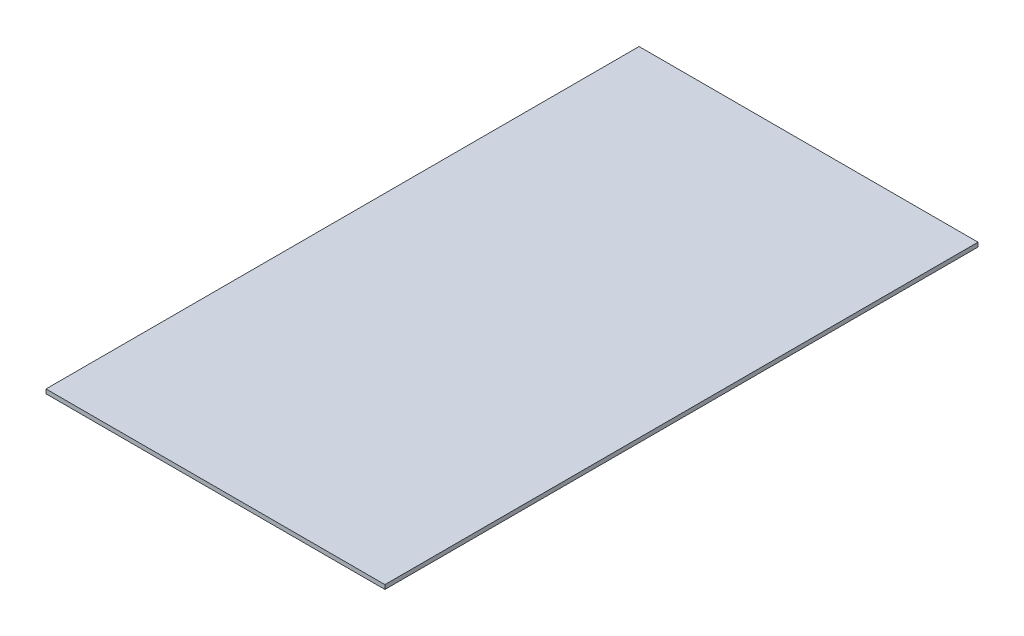
ISO-10303-21;
HEADER;
FILE_DESCRIPTION(('STEP AP214'),'2;1');
FILE_NAME('part.step','',(''),(''),'','','');
FILE_SCHEMA(('AUTOMOTIVE_DESIGN { 1 0 10303 214 1 1 1 1 }'));
ENDSEC;
DATA;
#1=APPLICATION_CONTEXT('core data for automotive mechanical design processes');
#2=APPLICATION_PROTOCOL_DEFINITION('international standard','automotive_design',2000,#1);
#3=PRODUCT_CONTEXT('',#1,'mechanical');
#4=PRODUCT('Part','Part','',(#3));
#5=PRODUCT_RELATED_PRODUCT_CATEGORY('part','',(#4));
#6=PRODUCT_DEFINITION_FORMATION('','',#4);
#7=PRODUCT_DEFINITION_CONTEXT('part definition',#1,'design');
#8=PRODUCT_DEFINITION('design','',#6,#7);
#9=PRODUCT_DEFINITION_SHAPE('','',#8);
#10=(LENGTH_UNIT() NAMED_UNIT(*) SI_UNIT(.MILLI.,.METRE.));
#11=(NAMED_UNIT(*) PLANE_ANGLE_UNIT() SI_UNIT($,.RADIAN.));
#12=(NAMED_UNIT(*) SI_UNIT($,.STERADIAN.) SOLID_ANGLE_UNIT());
#13=UNCERTAINTY_MEASURE_WITH_UNIT(LENGTH_MEASURE(1.E-05),#10,'distance_accuracy_value','');
#14=(GEOMETRIC_REPRESENTATION_CONTEXT(3) GLOBAL_UNCERTAINTY_ASSIGNED_CONTEXT((#13)) GLOBAL_UNIT_ASSIGNED_CONTEXT((#10,
#11,#12)) REPRESENTATION_CONTEXT('',''));
#15=CARTESIAN_POINT('',(0.,0.,0.));
#16=DIRECTION('',(0.,0.,1.));
#17=DIRECTION('',(1.,0.,0.));
#18=AXIS2_PLACEMENT_3D('',#15,#16,#17);
#19=CARTESIAN_POINT('',(-200.,5.,-350.));
#20=DIRECTION('',(1.,0.,0.));
#21=DIRECTION('',(0.,0.,-1.));
#22=AXIS2_PLACEMENT_3D('',#19,#20,#21);
#23=PLANE('',#22);
#24=DIRECTION('',(0.,0.,1.));
#25=VECTOR('',#24,1.);
#26=CARTESIAN_POINT('',(-200.,0.,-350.));
#27=LINE('',#26,#25);
#28=CARTESIAN_POINT('',(-200.,0.,-350.));
#29=VERTEX_POINT('',#28);
#30=CARTESIAN_POINT('',(-200.,0.,350.));
#31=VERTEX_POINT('',#30);
#32=EDGE_CURVE('E107',#29,#31,#27,.T.);
#33=ORIENTED_EDGE('',*,*,#32,.T.);
#34=DIRECTION('',(0.,-1.,0.));
#35=VECTOR('',#34,1.);
#36=CARTESIAN_POINT('',(-200.,5.,350.));
#37=LINE('',#36,#35);
#38=CARTESIAN_POINT('',(-200.,5.,350.));
#39=VERTEX_POINT('',#38);
#40=EDGE_CURVE('E11',#39,#31,#37,.T.);
#41=ORIENTED_EDGE('',*,*,#40,.F.);
#42=DIRECTION('',(0.,0.,1.));
#43=VECTOR('',#42,1.);
#44=CARTESIAN_POINT('',(-200.,5.,-350.));
#45=LINE('',#44,#43);
#46=CARTESIAN_POINT('',(-200.,5.,-350.));
#47=VERTEX_POINT('',#46);
#48=EDGE_CURVE('E91',#47,#39,#45,.T.);
#49=ORIENTED_EDGE('',*,*,#48,.F.);
#50=DIRECTION('',(0.,-1.,0.));
#51=VECTOR('',#50,1.);
#52=CARTESIAN_POINT('',(-200.,5.,-350.));
#53=LINE('',#52,#51);
#54=EDGE_CURVE('E103',#47,#29,#53,.T.);
#55=ORIENTED_EDGE('',*,*,#54,.T.);
#56=EDGE_LOOP('',(#33,#41,#49,#55));
#57=FACE_BOUND('',#56,.T.);
#58=ADVANCED_FACE('F39',(#57),#23,.F.);
#59=CARTESIAN_POINT('',(-200.,5.,350.));
#60=DIRECTION('',(0.,0.,-1.));
#61=DIRECTION('',(-1.,0.,0.));
#62=AXIS2_PLACEMENT_3D('',#59,#60,#61);
#63=PLANE('',#62);
#64=DIRECTION('',(1.,0.,0.));
#65=VECTOR('',#64,1.);
#66=CARTESIAN_POINT('',(-200.,0.,350.));
#67=LINE('',#66,#65);
#68=CARTESIAN_POINT('',(200.,0.,350.));
#69=VERTEX_POINT('',#68);
#70=EDGE_CURVE('E96',#31,#69,#67,.T.);
#71=ORIENTED_EDGE('',*,*,#70,.T.);
#72=DIRECTION('',(0.,-1.,0.));
#73=VECTOR('',#72,1.);
#74=CARTESIAN_POINT('',(200.,5.,350.));
#75=LINE('',#74,#73);
#76=CARTESIAN_POINT('',(200.,5.,350.));
#77=VERTEX_POINT('',#76);
#78=EDGE_CURVE('E48',#77,#69,#75,.T.);
#79=ORIENTED_EDGE('',*,*,#78,.F.);
#80=DIRECTION('',(1.,0.,0.));
#81=VECTOR('',#80,1.);
#82=CARTESIAN_POINT('',(-200.,5.,350.));
#83=LINE('',#82,#81);
#84=EDGE_CURVE('E86',#39,#77,#83,.T.);
#85=ORIENTED_EDGE('',*,*,#84,.F.);
#86=ORIENTED_EDGE('',*,*,#40,.T.);
#87=EDGE_LOOP('',(#71,#79,#85,#86));
#88=FACE_BOUND('',#87,.T.);
#89=ADVANCED_FACE('F95',(#88),#63,.F.);
#90=CARTESIAN_POINT('',(200.,5.,-350.));
#91=DIRECTION('',(-1.,0.,0.));
#92=DIRECTION('',(0.,0.,1.));
#93=AXIS2_PLACEMENT_3D('',#90,#91,#92);
#94=PLANE('',#93);
#95=DIRECTION('',(0.,0.,-1.));
#96=VECTOR('',#95,1.);
#97=CARTESIAN_POINT('',(200.,0.,-350.));
#98=LINE('',#97,#96);
#99=CARTESIAN_POINT('',(200.,0.,-350.));
#100=VERTEX_POINT('',#99);
#101=EDGE_CURVE('E73',#69,#100,#98,.T.);
#102=ORIENTED_EDGE('',*,*,#101,.T.);
#103=DIRECTION('',(0.,-1.,0.));
#104=VECTOR('',#103,1.);
#105=CARTESIAN_POINT('',(200.,5.,-350.));
#106=LINE('',#105,#104);
#107=CARTESIAN_POINT('',(200.,5.,-350.));
#108=VERTEX_POINT('',#107);
#109=EDGE_CURVE('E98',#108,#100,#106,.T.);
#110=ORIENTED_EDGE('',*,*,#109,.F.);
#111=DIRECTION('',(0.,0.,-1.));
#112=VECTOR('',#111,1.);
#113=CARTESIAN_POINT('',(200.,5.,-350.));
#114=LINE('',#113,#112);
#115=EDGE_CURVE('E89',#77,#108,#114,.T.);
#116=ORIENTED_EDGE('',*,*,#115,.F.);
#117=ORIENTED_EDGE('',*,*,#78,.T.);
#118=EDGE_LOOP('',(#102,#110,#116,#117));
#119=FACE_BOUND('',#118,.T.);
#120=ADVANCED_FACE('F99',(#119),#94,.F.);
#121=CARTESIAN_POINT('',(-200.,5.,-350.));
#122=DIRECTION('',(0.,0.,1.));
#123=DIRECTION('',(1.,0.,0.));
#124=AXIS2_PLACEMENT_3D('',#121,#122,#123);
#125=PLANE('',#124);
#126=DIRECTION('',(-1.,0.,0.));
#127=VECTOR('',#126,1.);
#128=CARTESIAN_POINT('',(-200.,0.,-350.));
#129=LINE('',#128,#127);
#130=EDGE_CURVE('E79',#100,#29,#129,.T.);
#131=ORIENTED_EDGE('',*,*,#130,.T.);
#132=ORIENTED_EDGE('',*,*,#54,.F.);
#133=DIRECTION('',(-1.,0.,0.));
#134=VECTOR('',#133,1.);
#135=CARTESIAN_POINT('',(-200.,5.,-350.));
#136=LINE('',#135,#134);
#137=EDGE_CURVE('E56',#108,#47,#136,.T.);
#138=ORIENTED_EDGE('',*,*,#137,.F.);
#139=ORIENTED_EDGE('',*,*,#109,.T.);
#140=EDGE_LOOP('',(#131,#132,#138,#139));
#141=FACE_BOUND('',#140,.T.);
#142=ADVANCED_FACE('F120',(#141),#125,.F.);
#143=CARTESIAN_POINT('',(0.,5.,0.));
#144=DIRECTION('',(0.,1.,0.));
#145=DIRECTION('',(0.,0.,1.));
#146=AXIS2_PLACEMENT_3D('',#143,#144,#145);
#147=PLANE('',#146);
#148=ORIENTED_EDGE('',*,*,#48,.T.);
#149=ORIENTED_EDGE('',*,*,#84,.T.);
#150=ORIENTED_EDGE('',*,*,#115,.T.);
#151=ORIENTED_EDGE('',*,*,#137,.T.);
#152=EDGE_LOOP('',(#148,#149,#150,#151));
#153=FACE_BOUND('',#152,.T.);
#154=ADVANCED_FACE('F87',(#153),#147,.T.);
#155=CARTESIAN_POINT('',(0.,0.,0.));
#156=DIRECTION('',(0.,1.,0.));
#157=DIRECTION('',(0.,0.,1.));
#158=AXIS2_PLACEMENT_3D('',#155,#156,#157);
#159=PLANE('',#158);
#160=ORIENTED_EDGE('',*,*,#32,.F.);
#161=ORIENTED_EDGE('',*,*,#130,.F.);
#162=ORIENTED_EDGE('',*,*,#101,.F.);
#163=ORIENTED_EDGE('',*,*,#70,.F.);
#164=EDGE_LOOP('',(#160,#161,#162,#163));
#165=FACE_BOUND('',#164,.T.);
#166=ADVANCED_FACE('F123',(#165),#159,.F.);
#167=CLOSED_SHELL('',(#58,#89,#120,#142,#154,#166));
#168=MANIFOLD_SOLID_BREP('B2',#167);
#169=ADVANCED_BREP_SHAPE_REPRESENTATION('',(#18,#168),#14);
#170=SHAPE_DEFINITION_REPRESENTATION(#9,#169);
ENDSEC;
END-ISO-10303-21;
